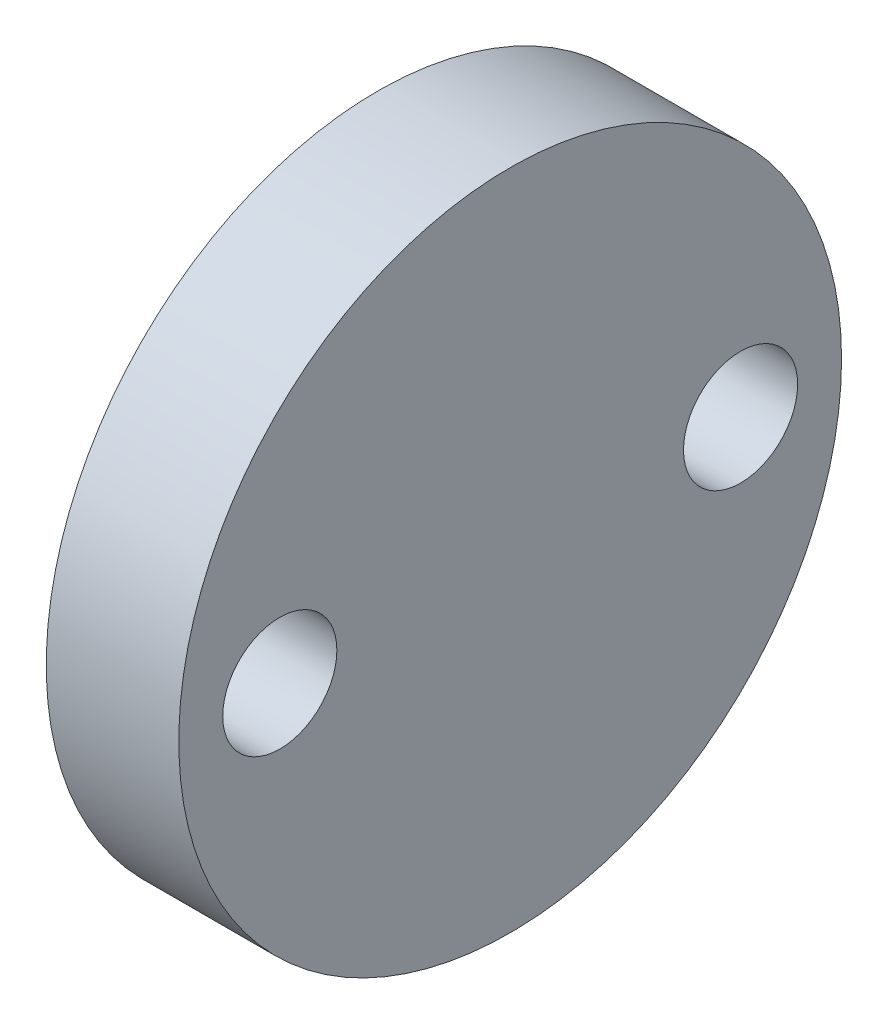
ISO-10303-21;
HEADER;
FILE_DESCRIPTION(('STEP AP214'),'2;1');
FILE_NAME('part.step','',(''),(''),'','','');
FILE_SCHEMA(('AUTOMOTIVE_DESIGN { 1 0 10303 214 1 1 1 1 }'));
ENDSEC;
DATA;
#1=APPLICATION_CONTEXT('core data for automotive mechanical design processes');
#2=APPLICATION_PROTOCOL_DEFINITION('international standard','automotive_design',2000,#1);
#3=PRODUCT_CONTEXT('',#1,'mechanical');
#4=PRODUCT('Part','Part','',(#3));
#5=PRODUCT_RELATED_PRODUCT_CATEGORY('part','',(#4));
#6=PRODUCT_DEFINITION_FORMATION('','',#4);
#7=PRODUCT_DEFINITION_CONTEXT('part definition',#1,'design');
#8=PRODUCT_DEFINITION('design','',#6,#7);
#9=PRODUCT_DEFINITION_SHAPE('','',#8);
#10=(LENGTH_UNIT() NAMED_UNIT(*) SI_UNIT(.MILLI.,.METRE.));
#11=(NAMED_UNIT(*) PLANE_ANGLE_UNIT() SI_UNIT($,.RADIAN.));
#12=(NAMED_UNIT(*) SI_UNIT($,.STERADIAN.) SOLID_ANGLE_UNIT());
#13=UNCERTAINTY_MEASURE_WITH_UNIT(LENGTH_MEASURE(1.E-05),#10,'distance_accuracy_value','');
#14=(GEOMETRIC_REPRESENTATION_CONTEXT(3) GLOBAL_UNCERTAINTY_ASSIGNED_CONTEXT((#13)) GLOBAL_UNIT_ASSIGNED_CONTEXT((#10,
#11,#12)) REPRESENTATION_CONTEXT('',''));
#15=CARTESIAN_POINT('',(0.,0.,0.));
#16=DIRECTION('',(0.,0.,1.));
#17=DIRECTION('',(1.,0.,0.));
#18=AXIS2_PLACEMENT_3D('',#15,#16,#17);
#19=CARTESIAN_POINT('',(5.,0.,0.));
#20=DIRECTION('',(-1.,0.,0.));
#21=DIRECTION('',(0.,0.,1.));
#22=AXIS2_PLACEMENT_3D('',#19,#20,#21);
#23=CYLINDRICAL_SURFACE('',#22,12.5);
#24=CARTESIAN_POINT('',(5.,0.,0.));
#25=DIRECTION('',(1.,0.,0.));
#26=DIRECTION('',(0.,0.,-1.));
#27=AXIS2_PLACEMENT_3D('',#24,#25,#26);
#28=CIRCLE('',#27,12.5);
#29=CARTESIAN_POINT('',(5.,0.,-12.5));
#30=VERTEX_POINT('',#29);
#31=EDGE_CURVE('E10',#30,#30,#28,.T.);
#32=ORIENTED_EDGE('',*,*,#31,.F.);
#33=EDGE_LOOP('',(#32));
#34=FACE_BOUND('',#33,.T.);
#35=CARTESIAN_POINT('',(0.,0.,0.));
#36=DIRECTION('',(1.,0.,0.));
#37=DIRECTION('',(0.,0.,-1.));
#38=AXIS2_PLACEMENT_3D('',#35,#36,#37);
#39=CIRCLE('',#38,12.5);
#40=CARTESIAN_POINT('',(0.,0.,-12.5));
#41=VERTEX_POINT('',#40);
#42=EDGE_CURVE('E35',#41,#41,#39,.T.);
#43=ORIENTED_EDGE('',*,*,#42,.T.);
#44=EDGE_LOOP('',(#43));
#45=FACE_BOUND('',#44,.T.);
#46=ADVANCED_FACE('F32',(#34,#45),#23,.T.);
#47=CARTESIAN_POINT('',(5.,0.,0.));
#48=DIRECTION('',(1.,0.,0.));
#49=DIRECTION('',(0.,0.,-1.));
#50=AXIS2_PLACEMENT_3D('',#47,#48,#49);
#51=PLANE('',#50);
#52=CARTESIAN_POINT('',(5.,0.,-8.69));
#53=DIRECTION('',(1.,0.,0.));
#54=DIRECTION('',(0.,0.,-1.));
#55=AXIS2_PLACEMENT_3D('',#52,#53,#54);
#56=CIRCLE('',#55,2.15264999999999);
#57=CARTESIAN_POINT('',(5.,0.,-10.84265));
#58=VERTEX_POINT('',#57);
#59=EDGE_CURVE('E49',#58,#58,#56,.T.);
#60=ORIENTED_EDGE('',*,*,#59,.F.);
#61=EDGE_LOOP('',(#60));
#62=FACE_BOUND('',#61,.T.);
#63=CARTESIAN_POINT('',(5.,0.,8.69));
#64=DIRECTION('',(1.,0.,0.));
#65=DIRECTION('',(0.,0.,-1.));
#66=AXIS2_PLACEMENT_3D('',#63,#64,#65);
#67=CIRCLE('',#66,2.15264999999999);
#68=CARTESIAN_POINT('',(5.,0.,6.53735000000001));
#69=VERTEX_POINT('',#68);
#70=EDGE_CURVE('E42',#69,#69,#67,.T.);
#71=ORIENTED_EDGE('',*,*,#70,.F.);
#72=EDGE_LOOP('',(#71));
#73=FACE_BOUND('',#72,.T.);
#74=ORIENTED_EDGE('',*,*,#31,.T.);
#75=EDGE_LOOP('',(#74));
#76=FACE_BOUND('',#75,.T.);
#77=ADVANCED_FACE('F62',(#62,#73,#76),#51,.T.);
#78=CARTESIAN_POINT('',(0.,0.,0.));
#79=DIRECTION('',(1.,0.,0.));
#80=DIRECTION('',(0.,0.,-1.));
#81=AXIS2_PLACEMENT_3D('',#78,#79,#80);
#82=PLANE('',#81);
#83=CARTESIAN_POINT('',(0.,0.,-8.69));
#84=DIRECTION('',(-1.,0.,0.));
#85=DIRECTION('',(0.,0.,1.));
#86=AXIS2_PLACEMENT_3D('',#83,#84,#85);
#87=CIRCLE('',#86,2.15264999999999);
#88=CARTESIAN_POINT('',(0.,0.,-6.53735000000001));
#89=VERTEX_POINT('',#88);
#90=EDGE_CURVE('E52',#89,#89,#87,.T.);
#91=ORIENTED_EDGE('',*,*,#90,.F.);
#92=EDGE_LOOP('',(#91));
#93=FACE_BOUND('',#92,.T.);
#94=CARTESIAN_POINT('',(0.,0.,8.69));
#95=DIRECTION('',(-1.,0.,0.));
#96=DIRECTION('',(0.,0.,1.));
#97=AXIS2_PLACEMENT_3D('',#94,#95,#96);
#98=CIRCLE('',#97,2.15264999999999);
#99=CARTESIAN_POINT('',(0.,0.,10.84265));
#100=VERTEX_POINT('',#99);
#101=EDGE_CURVE('E46',#100,#100,#98,.T.);
#102=ORIENTED_EDGE('',*,*,#101,.F.);
#103=EDGE_LOOP('',(#102));
#104=FACE_BOUND('',#103,.T.);
#105=ORIENTED_EDGE('',*,*,#42,.F.);
#106=EDGE_LOOP('',(#105));
#107=FACE_BOUND('',#106,.T.);
#108=ADVANCED_FACE('F58',(#93,#104,#107),#82,.F.);
#109=CARTESIAN_POINT('',(0.,0.,8.69));
#110=DIRECTION('',(-1.,0.,0.));
#111=DIRECTION('',(0.,0.,1.));
#112=AXIS2_PLACEMENT_3D('',#109,#110,#111);
#113=CYLINDRICAL_SURFACE('',#112,2.15264999999999);
#114=ORIENTED_EDGE('',*,*,#70,.T.);
#115=EDGE_LOOP('',(#114));
#116=FACE_BOUND('',#115,.T.);
#117=ORIENTED_EDGE('',*,*,#101,.T.);
#118=EDGE_LOOP('',(#117));
#119=FACE_BOUND('',#118,.T.);
#120=ADVANCED_FACE('F61',(#116,#119),#113,.F.);
#121=CARTESIAN_POINT('',(0.,0.,-8.69));
#122=DIRECTION('',(-1.,0.,0.));
#123=DIRECTION('',(0.,0.,1.));
#124=AXIS2_PLACEMENT_3D('',#121,#122,#123);
#125=CYLINDRICAL_SURFACE('',#124,2.15264999999999);
#126=ORIENTED_EDGE('',*,*,#59,.T.);
#127=EDGE_LOOP('',(#126));
#128=FACE_BOUND('',#127,.T.);
#129=ORIENTED_EDGE('',*,*,#90,.T.);
#130=EDGE_LOOP('',(#129));
#131=FACE_BOUND('',#130,.T.);
#132=ADVANCED_FACE('F56',(#128,#131),#125,.F.);
#133=CLOSED_SHELL('',(#46,#77,#108,#120,#132));
#134=MANIFOLD_SOLID_BREP('B2',#133);
#135=ADVANCED_BREP_SHAPE_REPRESENTATION('',(#18,#134),#14);
#136=SHAPE_DEFINITION_REPRESENTATION(#9,#135);
ENDSEC;
END-ISO-10303-21;
